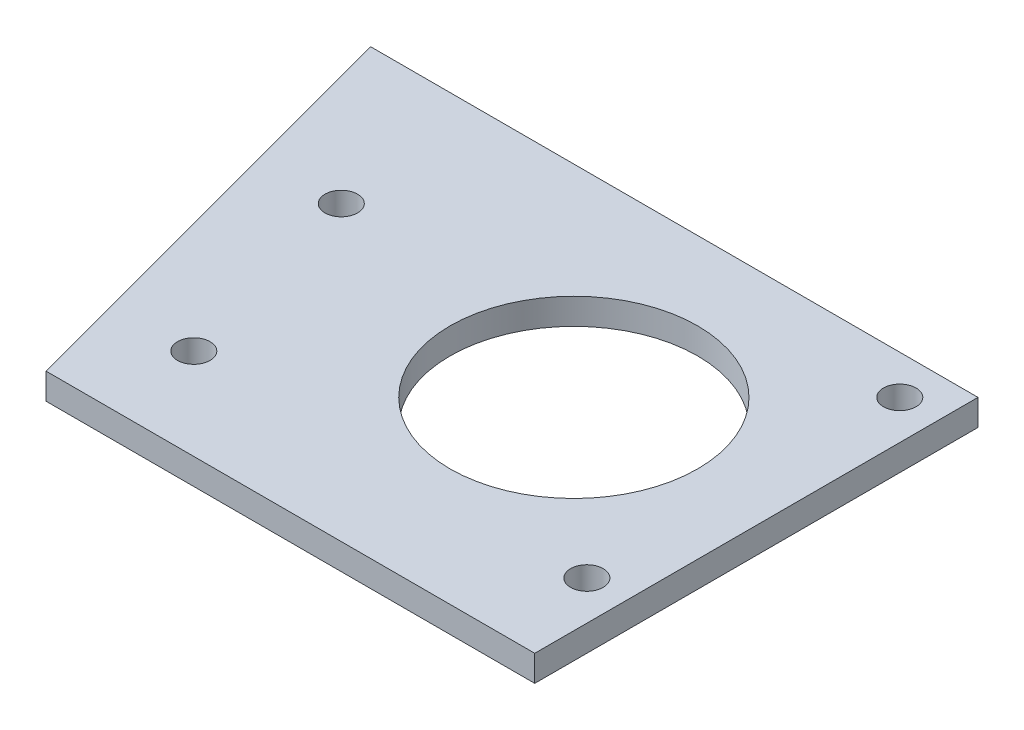
ISO-10303-21;
HEADER;
FILE_DESCRIPTION(('STEP AP214'),'2;1');
FILE_NAME('part.step','',(''),(''),'','','');
FILE_SCHEMA(('AUTOMOTIVE_DESIGN { 1 0 10303 214 1 1 1 1 }'));
ENDSEC;
DATA;
#1=APPLICATION_CONTEXT('core data for automotive mechanical design processes');
#2=APPLICATION_PROTOCOL_DEFINITION('international standard','automotive_design',2000,#1);
#3=PRODUCT_CONTEXT('',#1,'mechanical');
#4=PRODUCT('Part','Part','',(#3));
#5=PRODUCT_RELATED_PRODUCT_CATEGORY('part','',(#4));
#6=PRODUCT_DEFINITION_FORMATION('','',#4);
#7=PRODUCT_DEFINITION_CONTEXT('part definition',#1,'design');
#8=PRODUCT_DEFINITION('design','',#6,#7);
#9=PRODUCT_DEFINITION_SHAPE('','',#8);
#10=(LENGTH_UNIT() NAMED_UNIT(*) SI_UNIT(.MILLI.,.METRE.));
#11=(NAMED_UNIT(*) PLANE_ANGLE_UNIT() SI_UNIT($,.RADIAN.));
#12=(NAMED_UNIT(*) SI_UNIT($,.STERADIAN.) SOLID_ANGLE_UNIT());
#13=UNCERTAINTY_MEASURE_WITH_UNIT(LENGTH_MEASURE(1.E-05),#10,'distance_accuracy_value','');
#14=(GEOMETRIC_REPRESENTATION_CONTEXT(3) GLOBAL_UNCERTAINTY_ASSIGNED_CONTEXT((#13)) GLOBAL_UNIT_ASSIGNED_CONTEXT((#10,
#11,#12)) REPRESENTATION_CONTEXT('',''));
#15=CARTESIAN_POINT('',(0.,0.,0.));
#16=DIRECTION('',(0.,0.,1.));
#17=DIRECTION('',(1.,0.,0.));
#18=AXIS2_PLACEMENT_3D('',#15,#16,#17);
#19=CARTESIAN_POINT('',(0.,10.,0.));
#20=DIRECTION('',(0.,-1.,0.));
#21=DIRECTION('',(0.,0.,-1.));
#22=AXIS2_PLACEMENT_3D('',#19,#20,#21);
#23=PLANE('',#22);
#24=DIRECTION('',(0.,0.,-1.));
#25=VECTOR('',#24,1.);
#26=CARTESIAN_POINT('',(77.5,10.,77.5));
#27=LINE('',#26,#25);
#28=CARTESIAN_POINT('',(77.5,10.,92.5));
#29=VERTEX_POINT('',#28);
#30=CARTESIAN_POINT('',(77.5,10.,-77.5));
#31=VERTEX_POINT('',#30);
#32=EDGE_CURVE('E53',#29,#31,#27,.T.);
#33=ORIENTED_EDGE('',*,*,#32,.T.);
#34=DIRECTION('',(-1.,0.,0.));
#35=VECTOR('',#34,1.);
#36=CARTESIAN_POINT('',(-77.5,10.,-77.5));
#37=LINE('',#36,#35);
#38=CARTESIAN_POINT('',(-155.5,10.,-77.5));
#39=VERTEX_POINT('',#38);
#40=EDGE_CURVE('E84',#31,#39,#37,.T.);
#41=ORIENTED_EDGE('',*,*,#40,.T.);
#42=DIRECTION('',(0.258819045102518,0.,0.965925826289069));
#43=VECTOR('',#42,1.);
#44=CARTESIAN_POINT('',(-109.94863728671,10.,92.5));
#45=LINE('',#44,#43);
#46=CARTESIAN_POINT('',(-109.94863728671,10.,92.5));
#47=VERTEX_POINT('',#46);
#48=EDGE_CURVE('E88',#39,#47,#45,.T.);
#49=ORIENTED_EDGE('',*,*,#48,.T.);
#50=DIRECTION('',(1.,0.,0.));
#51=VECTOR('',#50,1.);
#52=CARTESIAN_POINT('',(77.5,10.,92.5));
#53=LINE('',#52,#51);
#54=EDGE_CURVE('E94',#47,#29,#53,.T.);
#55=ORIENTED_EDGE('',*,*,#54,.T.);
#56=EDGE_LOOP('',(#33,#41,#49,#55));
#57=FACE_BOUND('',#56,.T.);
#58=CARTESIAN_POINT('',(0.,10.,0.));
#59=DIRECTION('',(0.,1.,0.));
#60=DIRECTION('',(0.,0.,1.));
#61=AXIS2_PLACEMENT_3D('',#58,#59,#60);
#62=CIRCLE('',#61,47.5);
#63=CARTESIAN_POINT('',(0.,10.,47.5));
#64=VERTEX_POINT('',#63);
#65=EDGE_CURVE('E101',#64,#64,#62,.T.);
#66=ORIENTED_EDGE('',*,*,#65,.F.);
#67=EDGE_LOOP('',(#66));
#68=FACE_BOUND('',#67,.T.);
#69=CARTESIAN_POINT('',(62.5,10.,-62.5));
#70=DIRECTION('',(0.,1.,0.));
#71=DIRECTION('',(0.,0.,1.));
#72=AXIS2_PLACEMENT_3D('',#69,#70,#71);
#73=CIRCLE('',#72,6.25);
#74=CARTESIAN_POINT('',(62.5,10.,-56.25));
#75=VERTEX_POINT('',#74);
#76=EDGE_CURVE('E173',#75,#75,#73,.T.);
#77=ORIENTED_EDGE('',*,*,#76,.F.);
#78=EDGE_LOOP('',(#77));
#79=FACE_BOUND('',#78,.T.);
#80=CARTESIAN_POINT('',(62.5,10.,57.5));
#81=DIRECTION('',(0.,1.,0.));
#82=DIRECTION('',(0.,0.,1.));
#83=AXIS2_PLACEMENT_3D('',#80,#81,#82);
#84=CIRCLE('',#83,6.25);
#85=CARTESIAN_POINT('',(62.5,10.,63.75));
#86=VERTEX_POINT('',#85);
#87=EDGE_CURVE('E167',#86,#86,#84,.T.);
#88=ORIENTED_EDGE('',*,*,#87,.F.);
#89=EDGE_LOOP('',(#88));
#90=FACE_BOUND('',#89,.T.);
#91=CARTESIAN_POINT('',(-88.2685736094964,10.,57.5));
#92=DIRECTION('',(0.,1.,0.));
#93=DIRECTION('',(0.,0.,1.));
#94=AXIS2_PLACEMENT_3D('',#91,#92,#93);
#95=CIRCLE('',#94,6.25);
#96=CARTESIAN_POINT('',(-88.2685736094964,10.,63.75));
#97=VERTEX_POINT('',#96);
#98=EDGE_CURVE('E161',#97,#97,#95,.T.);
#99=ORIENTED_EDGE('',*,*,#98,.F.);
#100=EDGE_LOOP('',(#99));
#101=FACE_BOUND('',#100,.T.);
#102=CARTESIAN_POINT('',(-108.974097217698,10.,-19.7740661031255));
#103=DIRECTION('',(0.,1.,0.));
#104=DIRECTION('',(0.,0.,1.));
#105=AXIS2_PLACEMENT_3D('',#102,#103,#104);
#106=CIRCLE('',#105,6.25);
#107=CARTESIAN_POINT('',(-108.974097217698,10.,-13.5240661031255));
#108=VERTEX_POINT('',#107);
#109=EDGE_CURVE('E152',#108,#108,#106,.T.);
#110=ORIENTED_EDGE('',*,*,#109,.F.);
#111=EDGE_LOOP('',(#110));
#112=FACE_BOUND('',#111,.T.);
#113=ADVANCED_FACE('F36',(#57,#68,#79,#90,#101,#112),#23,.F.);
#114=CARTESIAN_POINT('',(0.,0.,0.));
#115=DIRECTION('',(0.,-1.,0.));
#116=DIRECTION('',(0.,0.,-1.));
#117=AXIS2_PLACEMENT_3D('',#114,#115,#116);
#118=PLANE('',#117);
#119=CARTESIAN_POINT('',(-88.2685736094964,0.,57.5));
#120=DIRECTION('',(0.,1.,0.));
#121=DIRECTION('',(0.,0.,1.));
#122=AXIS2_PLACEMENT_3D('',#119,#120,#121);
#123=CIRCLE('',#122,6.25);
#124=CARTESIAN_POINT('',(-88.2685736094964,0.,63.75));
#125=VERTEX_POINT('',#124);
#126=EDGE_CURVE('E158',#125,#125,#123,.T.);
#127=ORIENTED_EDGE('',*,*,#126,.T.);
#128=EDGE_LOOP('',(#127));
#129=FACE_BOUND('',#128,.T.);
#130=CARTESIAN_POINT('',(62.5,0.,-62.5));
#131=DIRECTION('',(0.,1.,0.));
#132=DIRECTION('',(0.,0.,1.));
#133=AXIS2_PLACEMENT_3D('',#130,#131,#132);
#134=CIRCLE('',#133,6.25);
#135=CARTESIAN_POINT('',(62.5,0.,-56.25));
#136=VERTEX_POINT('',#135);
#137=EDGE_CURVE('E170',#136,#136,#134,.T.);
#138=ORIENTED_EDGE('',*,*,#137,.T.);
#139=EDGE_LOOP('',(#138));
#140=FACE_BOUND('',#139,.T.);
#141=DIRECTION('',(-1.,0.,0.));
#142=VECTOR('',#141,1.);
#143=CARTESIAN_POINT('',(-155.5,0.,-77.5));
#144=LINE('',#143,#142);
#145=CARTESIAN_POINT('',(77.5,0.,-77.5));
#146=VERTEX_POINT('',#145);
#147=CARTESIAN_POINT('',(-155.5,0.,-77.5));
#148=VERTEX_POINT('',#147);
#149=EDGE_CURVE('E90',#146,#148,#144,.T.);
#150=ORIENTED_EDGE('',*,*,#149,.F.);
#151=DIRECTION('',(0.,0.,-1.));
#152=VECTOR('',#151,1.);
#153=CARTESIAN_POINT('',(77.5,0.,77.5));
#154=LINE('',#153,#152);
#155=CARTESIAN_POINT('',(77.5,0.,92.5));
#156=VERTEX_POINT('',#155);
#157=EDGE_CURVE('E104',#156,#146,#154,.T.);
#158=ORIENTED_EDGE('',*,*,#157,.F.);
#159=DIRECTION('',(1.,0.,0.));
#160=VECTOR('',#159,1.);
#161=CARTESIAN_POINT('',(77.5,0.,92.5));
#162=LINE('',#161,#160);
#163=CARTESIAN_POINT('',(-109.94863728671,0.,92.5));
#164=VERTEX_POINT('',#163);
#165=EDGE_CURVE('E78',#164,#156,#162,.T.);
#166=ORIENTED_EDGE('',*,*,#165,.F.);
#167=DIRECTION('',(0.258819045102518,0.,0.965925826289069));
#168=VECTOR('',#167,1.);
#169=CARTESIAN_POINT('',(-109.94863728671,0.,92.5));
#170=LINE('',#169,#168);
#171=EDGE_CURVE('E71',#148,#164,#170,.T.);
#172=ORIENTED_EDGE('',*,*,#171,.F.);
#173=EDGE_LOOP('',(#150,#158,#166,#172));
#174=FACE_BOUND('',#173,.T.);
#175=CARTESIAN_POINT('',(0.,0.,0.));
#176=DIRECTION('',(0.,1.,0.));
#177=DIRECTION('',(0.,0.,1.));
#178=AXIS2_PLACEMENT_3D('',#175,#176,#177);
#179=CIRCLE('',#178,47.5);
#180=CARTESIAN_POINT('',(0.,0.,47.5));
#181=VERTEX_POINT('',#180);
#182=EDGE_CURVE('E176',#181,#181,#179,.T.);
#183=ORIENTED_EDGE('',*,*,#182,.T.);
#184=EDGE_LOOP('',(#183));
#185=FACE_BOUND('',#184,.T.);
#186=CARTESIAN_POINT('',(62.5,0.,57.5));
#187=DIRECTION('',(0.,1.,0.));
#188=DIRECTION('',(0.,0.,1.));
#189=AXIS2_PLACEMENT_3D('',#186,#187,#188);
#190=CIRCLE('',#189,6.25);
#191=CARTESIAN_POINT('',(62.5,0.,63.75));
#192=VERTEX_POINT('',#191);
#193=EDGE_CURVE('E164',#192,#192,#190,.T.);
#194=ORIENTED_EDGE('',*,*,#193,.T.);
#195=EDGE_LOOP('',(#194));
#196=FACE_BOUND('',#195,.T.);
#197=CARTESIAN_POINT('',(-108.974097217698,0.,-19.7740661031255));
#198=DIRECTION('',(0.,1.,0.));
#199=DIRECTION('',(0.,0.,1.));
#200=AXIS2_PLACEMENT_3D('',#197,#198,#199);
#201=CIRCLE('',#200,6.25);
#202=CARTESIAN_POINT('',(-108.974097217698,0.,-13.5240661031255));
#203=VERTEX_POINT('',#202);
#204=EDGE_CURVE('E155',#203,#203,#201,.T.);
#205=ORIENTED_EDGE('',*,*,#204,.T.);
#206=EDGE_LOOP('',(#205));
#207=FACE_BOUND('',#206,.T.);
#208=ADVANCED_FACE('F111',(#129,#140,#174,#185,#196,#207),#118,.T.);
#209=CARTESIAN_POINT('',(-155.5,10.,-77.5));
#210=DIRECTION('',(0.,0.,1.));
#211=DIRECTION('',(1.,0.,0.));
#212=AXIS2_PLACEMENT_3D('',#209,#210,#211);
#213=PLANE('',#212);
#214=ORIENTED_EDGE('',*,*,#149,.T.);
#215=DIRECTION('',(0.,-1.,0.));
#216=VECTOR('',#215,1.);
#217=CARTESIAN_POINT('',(-155.5,10.,-77.5));
#218=LINE('',#217,#216);
#219=EDGE_CURVE('E45',#39,#148,#218,.T.);
#220=ORIENTED_EDGE('',*,*,#219,.F.);
#221=ORIENTED_EDGE('',*,*,#40,.F.);
#222=DIRECTION('',(0.,-1.,0.));
#223=VECTOR('',#222,1.);
#224=CARTESIAN_POINT('',(77.5,10.,-77.5));
#225=LINE('',#224,#223);
#226=EDGE_CURVE('E11',#31,#146,#225,.T.);
#227=ORIENTED_EDGE('',*,*,#226,.T.);
#228=EDGE_LOOP('',(#214,#220,#221,#227));
#229=FACE_BOUND('',#228,.T.);
#230=ADVANCED_FACE('F38',(#229),#213,.F.);
#231=CARTESIAN_POINT('',(-109.94863728671,10.,92.5));
#232=DIRECTION('',(0.965925826289069,0.,-0.258819045102518));
#233=DIRECTION('',(-0.258819045102518,0.,-0.965925826289069));
#234=AXIS2_PLACEMENT_3D('',#231,#232,#233);
#235=PLANE('',#234);
#236=ORIENTED_EDGE('',*,*,#171,.T.);
#237=DIRECTION('',(0.,-1.,0.));
#238=VECTOR('',#237,1.);
#239=CARTESIAN_POINT('',(-109.94863728671,10.,92.5));
#240=LINE('',#239,#238);
#241=EDGE_CURVE('E91',#47,#164,#240,.T.);
#242=ORIENTED_EDGE('',*,*,#241,.F.);
#243=ORIENTED_EDGE('',*,*,#48,.F.);
#244=ORIENTED_EDGE('',*,*,#219,.T.);
#245=EDGE_LOOP('',(#236,#242,#243,#244));
#246=FACE_BOUND('',#245,.T.);
#247=ADVANCED_FACE('F92',(#246),#235,.F.);
#248=CARTESIAN_POINT('',(77.5,10.,92.5));
#249=DIRECTION('',(0.,0.,-1.));
#250=DIRECTION('',(-1.,0.,0.));
#251=AXIS2_PLACEMENT_3D('',#248,#249,#250);
#252=PLANE('',#251);
#253=ORIENTED_EDGE('',*,*,#165,.T.);
#254=DIRECTION('',(0.,-1.,0.));
#255=VECTOR('',#254,1.);
#256=CARTESIAN_POINT('',(77.5,10.,92.5));
#257=LINE('',#256,#255);
#258=EDGE_CURVE('E96',#29,#156,#257,.T.);
#259=ORIENTED_EDGE('',*,*,#258,.F.);
#260=ORIENTED_EDGE('',*,*,#54,.F.);
#261=ORIENTED_EDGE('',*,*,#241,.T.);
#262=EDGE_LOOP('',(#253,#259,#260,#261));
#263=FACE_BOUND('',#262,.T.);
#264=ADVANCED_FACE('F108',(#263),#252,.F.);
#265=CARTESIAN_POINT('',(77.5,10.,77.5));
#266=DIRECTION('',(-1.,0.,0.));
#267=DIRECTION('',(0.,0.,1.));
#268=AXIS2_PLACEMENT_3D('',#265,#266,#267);
#269=PLANE('',#268);
#270=ORIENTED_EDGE('',*,*,#157,.T.);
#271=ORIENTED_EDGE('',*,*,#226,.F.);
#272=ORIENTED_EDGE('',*,*,#32,.F.);
#273=ORIENTED_EDGE('',*,*,#258,.T.);
#274=EDGE_LOOP('',(#270,#271,#272,#273));
#275=FACE_BOUND('',#274,.T.);
#276=ADVANCED_FACE('F113',(#275),#269,.F.);
#277=CARTESIAN_POINT('',(0.,10.,0.));
#278=DIRECTION('',(0.,-1.,0.));
#279=DIRECTION('',(0.,0.,-1.));
#280=AXIS2_PLACEMENT_3D('',#277,#278,#279);
#281=CYLINDRICAL_SURFACE('',#280,47.5);
#282=ORIENTED_EDGE('',*,*,#65,.T.);
#283=EDGE_LOOP('',(#282));
#284=FACE_BOUND('',#283,.T.);
#285=ORIENTED_EDGE('',*,*,#182,.F.);
#286=EDGE_LOOP('',(#285));
#287=FACE_BOUND('',#286,.T.);
#288=ADVANCED_FACE('F115',(#284,#287),#281,.F.);
#289=CARTESIAN_POINT('',(62.5,10.,-62.5));
#290=DIRECTION('',(0.,-1.,0.));
#291=DIRECTION('',(0.,0.,-1.));
#292=AXIS2_PLACEMENT_3D('',#289,#290,#291);
#293=CYLINDRICAL_SURFACE('',#292,6.25);
#294=ORIENTED_EDGE('',*,*,#76,.T.);
#295=EDGE_LOOP('',(#294));
#296=FACE_BOUND('',#295,.T.);
#297=ORIENTED_EDGE('',*,*,#137,.F.);
#298=EDGE_LOOP('',(#297));
#299=FACE_BOUND('',#298,.T.);
#300=ADVANCED_FACE('F121',(#296,#299),#293,.F.);
#301=CARTESIAN_POINT('',(62.5,10.,57.5));
#302=DIRECTION('',(0.,-1.,0.));
#303=DIRECTION('',(0.,0.,-1.));
#304=AXIS2_PLACEMENT_3D('',#301,#302,#303);
#305=CYLINDRICAL_SURFACE('',#304,6.25);
#306=ORIENTED_EDGE('',*,*,#87,.T.);
#307=EDGE_LOOP('',(#306));
#308=FACE_BOUND('',#307,.T.);
#309=ORIENTED_EDGE('',*,*,#193,.F.);
#310=EDGE_LOOP('',(#309));
#311=FACE_BOUND('',#310,.T.);
#312=ADVANCED_FACE('F135',(#308,#311),#305,.F.);
#313=CARTESIAN_POINT('',(-88.2685736094964,10.,57.5));
#314=DIRECTION('',(0.,-1.,0.));
#315=DIRECTION('',(0.,0.,-1.));
#316=AXIS2_PLACEMENT_3D('',#313,#314,#315);
#317=CYLINDRICAL_SURFACE('',#316,6.25);
#318=ORIENTED_EDGE('',*,*,#98,.T.);
#319=EDGE_LOOP('',(#318));
#320=FACE_BOUND('',#319,.T.);
#321=ORIENTED_EDGE('',*,*,#126,.F.);
#322=EDGE_LOOP('',(#321));
#323=FACE_BOUND('',#322,.T.);
#324=ADVANCED_FACE('F139',(#320,#323),#317,.F.);
#325=CARTESIAN_POINT('',(-108.974097217698,10.,-19.7740661031255));
#326=DIRECTION('',(0.,-1.,0.));
#327=DIRECTION('',(0.,0.,-1.));
#328=AXIS2_PLACEMENT_3D('',#325,#326,#327);
#329=CYLINDRICAL_SURFACE('',#328,6.25);
#330=ORIENTED_EDGE('',*,*,#109,.T.);
#331=EDGE_LOOP('',(#330));
#332=FACE_BOUND('',#331,.T.);
#333=ORIENTED_EDGE('',*,*,#204,.F.);
#334=EDGE_LOOP('',(#333));
#335=FACE_BOUND('',#334,.T.);
#336=ADVANCED_FACE('F143',(#332,#335),#329,.F.);
#337=CLOSED_SHELL('',(#113,#208,#230,#247,#264,#276,#288,#300,#312,#324,#336));
#338=MANIFOLD_SOLID_BREP('B2',#337);
#339=ADVANCED_BREP_SHAPE_REPRESENTATION('',(#18,#338),#14);
#340=SHAPE_DEFINITION_REPRESENTATION(#9,#339);
ENDSEC;
END-ISO-10303-21;
